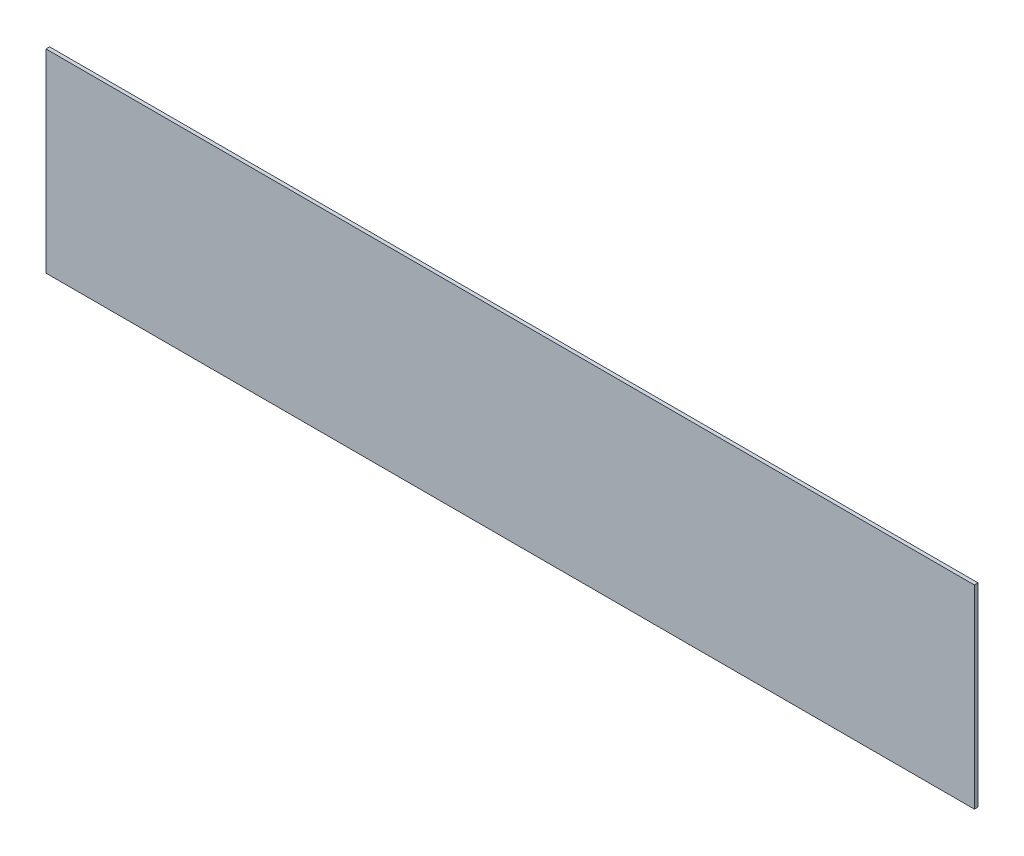
ISO-10303-21;
HEADER;
FILE_DESCRIPTION(('STEP AP214'),'2;1');
FILE_NAME('part.step','',(''),(''),'','','');
FILE_SCHEMA(('AUTOMOTIVE_DESIGN { 1 0 10303 214 1 1 1 1 }'));
ENDSEC;
DATA;
#1=APPLICATION_CONTEXT('core data for automotive mechanical design processes');
#2=APPLICATION_PROTOCOL_DEFINITION('international standard','automotive_design',2000,#1);
#3=PRODUCT_CONTEXT('',#1,'mechanical');
#4=PRODUCT('Part','Part','',(#3));
#5=PRODUCT_RELATED_PRODUCT_CATEGORY('part','',(#4));
#6=PRODUCT_DEFINITION_FORMATION('','',#4);
#7=PRODUCT_DEFINITION_CONTEXT('part definition',#1,'design');
#8=PRODUCT_DEFINITION('design','',#6,#7);
#9=PRODUCT_DEFINITION_SHAPE('','',#8);
#10=(LENGTH_UNIT() NAMED_UNIT(*) SI_UNIT(.MILLI.,.METRE.));
#11=(NAMED_UNIT(*) PLANE_ANGLE_UNIT() SI_UNIT($,.RADIAN.));
#12=(NAMED_UNIT(*) SI_UNIT($,.STERADIAN.) SOLID_ANGLE_UNIT());
#13=UNCERTAINTY_MEASURE_WITH_UNIT(LENGTH_MEASURE(1.E-05),#10,'distance_accuracy_value','');
#14=(GEOMETRIC_REPRESENTATION_CONTEXT(3) GLOBAL_UNCERTAINTY_ASSIGNED_CONTEXT((#13)) GLOBAL_UNIT_ASSIGNED_CONTEXT((#10,
#11,#12)) REPRESENTATION_CONTEXT('',''));
#15=CARTESIAN_POINT('',(0.,0.,0.));
#16=DIRECTION('',(0.,0.,1.));
#17=DIRECTION('',(1.,0.,0.));
#18=AXIS2_PLACEMENT_3D('',#15,#16,#17);
#19=CARTESIAN_POINT('',(607.21875,127.,4.7625));
#20=DIRECTION('',(-1.,0.,0.));
#21=DIRECTION('',(0.,-1.,0.));
#22=AXIS2_PLACEMENT_3D('',#19,#20,#21);
#23=PLANE('',#22);
#24=DIRECTION('',(0.,1.,0.));
#25=VECTOR('',#24,1.);
#26=CARTESIAN_POINT('',(607.21875,127.,0.));
#27=LINE('',#26,#25);
#28=CARTESIAN_POINT('',(607.21875,-127.,0.));
#29=VERTEX_POINT('',#28);
#30=CARTESIAN_POINT('',(607.21875,127.,0.));
#31=VERTEX_POINT('',#30);
#32=EDGE_CURVE('E96',#29,#31,#27,.T.);
#33=ORIENTED_EDGE('',*,*,#32,.T.);
#34=DIRECTION('',(0.,0.,-1.));
#35=VECTOR('',#34,1.);
#36=CARTESIAN_POINT('',(607.21875,127.,4.7625));
#37=LINE('',#36,#35);
#38=CARTESIAN_POINT('',(607.21875,127.,4.7625));
#39=VERTEX_POINT('',#38);
#40=EDGE_CURVE('E11',#39,#31,#37,.T.);
#41=ORIENTED_EDGE('',*,*,#40,.F.);
#42=DIRECTION('',(0.,1.,0.));
#43=VECTOR('',#42,1.);
#44=CARTESIAN_POINT('',(607.21875,127.,4.7625));
#45=LINE('',#44,#43);
#46=CARTESIAN_POINT('',(607.21875,-127.,4.7625));
#47=VERTEX_POINT('',#46);
#48=EDGE_CURVE('E84',#47,#39,#45,.T.);
#49=ORIENTED_EDGE('',*,*,#48,.F.);
#50=DIRECTION('',(0.,0.,-1.));
#51=VECTOR('',#50,1.);
#52=CARTESIAN_POINT('',(607.21875,-127.,4.7625));
#53=LINE('',#52,#51);
#54=EDGE_CURVE('E92',#47,#29,#53,.T.);
#55=ORIENTED_EDGE('',*,*,#54,.T.);
#56=EDGE_LOOP('',(#33,#41,#49,#55));
#57=FACE_BOUND('',#56,.T.);
#58=ADVANCED_FACE('F33',(#57),#23,.F.);
#59=CARTESIAN_POINT('',(-607.21875,127.,4.7625));
#60=DIRECTION('',(0.,-1.,0.));
#61=DIRECTION('',(0.,0.,-1.));
#62=AXIS2_PLACEMENT_3D('',#59,#60,#61);
#63=PLANE('',#62);
#64=DIRECTION('',(-1.,0.,0.));
#65=VECTOR('',#64,1.);
#66=CARTESIAN_POINT('',(-607.21875,127.,0.));
#67=LINE('',#66,#65);
#68=CARTESIAN_POINT('',(-607.21875,127.,0.));
#69=VERTEX_POINT('',#68);
#70=EDGE_CURVE('E88',#31,#69,#67,.T.);
#71=ORIENTED_EDGE('',*,*,#70,.T.);
#72=DIRECTION('',(0.,0.,-1.));
#73=VECTOR('',#72,1.);
#74=CARTESIAN_POINT('',(-607.21875,127.,4.7625));
#75=LINE('',#74,#73);
#76=CARTESIAN_POINT('',(-607.21875,127.,4.7625));
#77=VERTEX_POINT('',#76);
#78=EDGE_CURVE('E41',#77,#69,#75,.T.);
#79=ORIENTED_EDGE('',*,*,#78,.F.);
#80=DIRECTION('',(-1.,0.,0.));
#81=VECTOR('',#80,1.);
#82=CARTESIAN_POINT('',(-607.21875,127.,4.7625));
#83=LINE('',#82,#81);
#84=EDGE_CURVE('E79',#39,#77,#83,.T.);
#85=ORIENTED_EDGE('',*,*,#84,.F.);
#86=ORIENTED_EDGE('',*,*,#40,.T.);
#87=EDGE_LOOP('',(#71,#79,#85,#86));
#88=FACE_BOUND('',#87,.T.);
#89=ADVANCED_FACE('F87',(#88),#63,.F.);
#90=CARTESIAN_POINT('',(-607.21875,127.,4.7625));
#91=DIRECTION('',(1.,0.,0.));
#92=DIRECTION('',(0.,0.,-1.));
#93=AXIS2_PLACEMENT_3D('',#90,#91,#92);
#94=PLANE('',#93);
#95=DIRECTION('',(0.,-1.,0.));
#96=VECTOR('',#95,1.);
#97=CARTESIAN_POINT('',(-607.21875,127.,0.));
#98=LINE('',#97,#96);
#99=CARTESIAN_POINT('',(-607.21875,-127.,0.));
#100=VERTEX_POINT('',#99);
#101=EDGE_CURVE('E66',#69,#100,#98,.T.);
#102=ORIENTED_EDGE('',*,*,#101,.T.);
#103=DIRECTION('',(0.,0.,-1.));
#104=VECTOR('',#103,1.);
#105=CARTESIAN_POINT('',(-607.21875,-127.,4.7625));
#106=LINE('',#105,#104);
#107=CARTESIAN_POINT('',(-607.21875,-127.,4.7625));
#108=VERTEX_POINT('',#107);
#109=EDGE_CURVE('E89',#108,#100,#106,.T.);
#110=ORIENTED_EDGE('',*,*,#109,.F.);
#111=DIRECTION('',(0.,-1.,0.));
#112=VECTOR('',#111,1.);
#113=CARTESIAN_POINT('',(-607.21875,127.,4.7625));
#114=LINE('',#113,#112);
#115=EDGE_CURVE('E82',#77,#108,#114,.T.);
#116=ORIENTED_EDGE('',*,*,#115,.F.);
#117=ORIENTED_EDGE('',*,*,#78,.T.);
#118=EDGE_LOOP('',(#102,#110,#116,#117));
#119=FACE_BOUND('',#118,.T.);
#120=ADVANCED_FACE('F90',(#119),#94,.F.);
#121=CARTESIAN_POINT('',(-607.21875,-127.,4.7625));
#122=DIRECTION('',(0.,1.,0.));
#123=DIRECTION('',(0.,0.,1.));
#124=AXIS2_PLACEMENT_3D('',#121,#122,#123);
#125=PLANE('',#124);
#126=DIRECTION('',(1.,0.,0.));
#127=VECTOR('',#126,1.);
#128=CARTESIAN_POINT('',(-607.21875,-127.,0.));
#129=LINE('',#128,#127);
#130=EDGE_CURVE('E72',#100,#29,#129,.T.);
#131=ORIENTED_EDGE('',*,*,#130,.T.);
#132=ORIENTED_EDGE('',*,*,#54,.F.);
#133=DIRECTION('',(1.,0.,0.));
#134=VECTOR('',#133,1.);
#135=CARTESIAN_POINT('',(-607.21875,-127.,4.7625));
#136=LINE('',#135,#134);
#137=EDGE_CURVE('E49',#108,#47,#136,.T.);
#138=ORIENTED_EDGE('',*,*,#137,.F.);
#139=ORIENTED_EDGE('',*,*,#109,.T.);
#140=EDGE_LOOP('',(#131,#132,#138,#139));
#141=FACE_BOUND('',#140,.T.);
#142=ADVANCED_FACE('F103',(#141),#125,.F.);
#143=CARTESIAN_POINT('',(0.,0.,4.7625));
#144=DIRECTION('',(0.,0.,1.));
#145=DIRECTION('',(1.,0.,0.));
#146=AXIS2_PLACEMENT_3D('',#143,#144,#145);
#147=PLANE('',#146);
#148=ORIENTED_EDGE('',*,*,#48,.T.);
#149=ORIENTED_EDGE('',*,*,#84,.T.);
#150=ORIENTED_EDGE('',*,*,#115,.T.);
#151=ORIENTED_EDGE('',*,*,#137,.T.);
#152=EDGE_LOOP('',(#148,#149,#150,#151));
#153=FACE_BOUND('',#152,.T.);
#154=ADVANCED_FACE('F80',(#153),#147,.T.);
#155=CARTESIAN_POINT('',(0.,0.,0.));
#156=DIRECTION('',(0.,0.,1.));
#157=DIRECTION('',(1.,0.,0.));
#158=AXIS2_PLACEMENT_3D('',#155,#156,#157);
#159=PLANE('',#158);
#160=ORIENTED_EDGE('',*,*,#32,.F.);
#161=ORIENTED_EDGE('',*,*,#130,.F.);
#162=ORIENTED_EDGE('',*,*,#101,.F.);
#163=ORIENTED_EDGE('',*,*,#70,.F.);
#164=EDGE_LOOP('',(#160,#161,#162,#163));
#165=FACE_BOUND('',#164,.T.);
#166=ADVANCED_FACE('F106',(#165),#159,.F.);
#167=CLOSED_SHELL('',(#58,#89,#120,#142,#154,#166));
#168=MANIFOLD_SOLID_BREP('B2',#167);
#169=ADVANCED_BREP_SHAPE_REPRESENTATION('',(#18,#168),#14);
#170=SHAPE_DEFINITION_REPRESENTATION(#9,#169);
ENDSEC;
END-ISO-10303-21;
